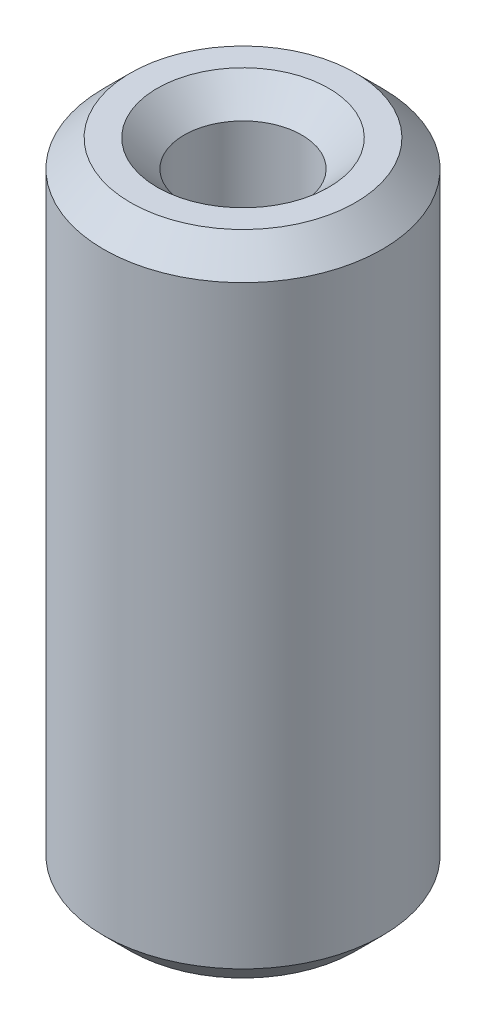
ISO-10303-21;
HEADER;
FILE_DESCRIPTION(('STEP AP214'),'2;1');
FILE_NAME('part.step','',(''),(''),'','','');
FILE_SCHEMA(('AUTOMOTIVE_DESIGN { 1 0 10303 214 1 1 1 1 }'));
ENDSEC;
DATA;
#1=APPLICATION_CONTEXT('core data for automotive mechanical design processes');
#2=APPLICATION_PROTOCOL_DEFINITION('international standard','automotive_design',2000,#1);
#3=PRODUCT_CONTEXT('',#1,'mechanical');
#4=PRODUCT('Part','Part','',(#3));
#5=PRODUCT_RELATED_PRODUCT_CATEGORY('part','',(#4));
#6=PRODUCT_DEFINITION_FORMATION('','',#4);
#7=PRODUCT_DEFINITION_CONTEXT('part definition',#1,'design');
#8=PRODUCT_DEFINITION('design','',#6,#7);
#9=PRODUCT_DEFINITION_SHAPE('','',#8);
#10=(LENGTH_UNIT() NAMED_UNIT(*) SI_UNIT(.MILLI.,.METRE.));
#11=(NAMED_UNIT(*) PLANE_ANGLE_UNIT() SI_UNIT($,.RADIAN.));
#12=(NAMED_UNIT(*) SI_UNIT($,.STERADIAN.) SOLID_ANGLE_UNIT());
#13=UNCERTAINTY_MEASURE_WITH_UNIT(LENGTH_MEASURE(1.E-05),#10,'distance_accuracy_value','');
#14=(GEOMETRIC_REPRESENTATION_CONTEXT(3) GLOBAL_UNCERTAINTY_ASSIGNED_CONTEXT((#13)) GLOBAL_UNIT_ASSIGNED_CONTEXT((#10,
#11,#12)) REPRESENTATION_CONTEXT('',''));
#15=CARTESIAN_POINT('',(0.,0.,0.));
#16=DIRECTION('',(0.,0.,1.));
#17=DIRECTION('',(1.,0.,0.));
#18=AXIS2_PLACEMENT_3D('',#15,#16,#17);
#19=CARTESIAN_POINT('',(0.,34.8866646161189,0.));
#20=DIRECTION('',(0.,-1.,0.));
#21=DIRECTION('',(0.,0.,-1.));
#22=AXIS2_PLACEMENT_3D('',#19,#20,#21);
#23=CYLINDRICAL_SURFACE('',#22,7.5);
#24=CARTESIAN_POINT('',(0.,1.45143759762098,0.));
#25=DIRECTION('',(0.,1.,0.));
#26=DIRECTION('',(0.,0.,1.));
#27=AXIS2_PLACEMENT_3D('',#24,#25,#26);
#28=CIRCLE('',#27,7.5);
#29=CARTESIAN_POINT('',(0.,1.45143759762098,7.5));
#30=VERTEX_POINT('',#29);
#31=EDGE_CURVE('E10',#30,#30,#28,.T.);
#32=ORIENTED_EDGE('',*,*,#31,.T.);
#33=EDGE_LOOP('',(#32));
#34=FACE_BOUND('',#33,.T.);
#35=CARTESIAN_POINT('',(0.,33.4352270184979,0.));
#36=DIRECTION('',(0.,1.,0.));
#37=DIRECTION('',(0.,0.,1.));
#38=AXIS2_PLACEMENT_3D('',#35,#36,#37);
#39=CIRCLE('',#38,7.5);
#40=CARTESIAN_POINT('',(0.,33.4352270184979,7.5));
#41=VERTEX_POINT('',#40);
#42=EDGE_CURVE('E50',#41,#41,#39,.F.);
#43=ORIENTED_EDGE('',*,*,#42,.T.);
#44=EDGE_LOOP('',(#43));
#45=FACE_BOUND('',#44,.T.);
#46=ADVANCED_FACE('F39',(#34,#45),#23,.T.);
#47=CARTESIAN_POINT('',(0.,34.8866646161189,0.));
#48=DIRECTION('',(0.,1.,0.));
#49=DIRECTION('',(0.,0.,1.));
#50=AXIS2_PLACEMENT_3D('',#47,#48,#49);
#51=PLANE('',#50);
#52=CARTESIAN_POINT('',(0.,34.8866646161189,0.));
#53=DIRECTION('',(0.,1.,0.));
#54=DIRECTION('',(0.,0.,1.));
#55=AXIS2_PLACEMENT_3D('',#52,#53,#54);
#56=CIRCLE('',#55,4.61648147498148);
#57=CARTESIAN_POINT('',(0.,34.8866646161189,4.61648147498148));
#58=VERTEX_POINT('',#57);
#59=EDGE_CURVE('E58',#58,#58,#56,.F.);
#60=ORIENTED_EDGE('',*,*,#59,.T.);
#61=EDGE_LOOP('',(#60));
#62=FACE_BOUND('',#61,.T.);
#63=CARTESIAN_POINT('',(0.,34.8866646161189,0.));
#64=DIRECTION('',(0.,1.,0.));
#65=DIRECTION('',(0.,0.,1.));
#66=AXIS2_PLACEMENT_3D('',#63,#64,#65);
#67=CIRCLE('',#66,6.04856240237902);
#68=CARTESIAN_POINT('',(0.,34.8866646161189,6.04856240237902));
#69=VERTEX_POINT('',#68);
#70=EDGE_CURVE('E61',#69,#69,#67,.T.);
#71=ORIENTED_EDGE('',*,*,#70,.T.);
#72=EDGE_LOOP('',(#71));
#73=FACE_BOUND('',#72,.T.);
#74=ADVANCED_FACE('F88',(#62,#73),#51,.T.);
#75=CARTESIAN_POINT('',(0.,0.,0.));
#76=DIRECTION('',(0.,1.,0.));
#77=DIRECTION('',(0.,0.,1.));
#78=AXIS2_PLACEMENT_3D('',#75,#76,#77);
#79=PLANE('',#78);
#80=CARTESIAN_POINT('',(0.,0.,0.));
#81=DIRECTION('',(0.,1.,0.));
#82=DIRECTION('',(0.,0.,1.));
#83=AXIS2_PLACEMENT_3D('',#80,#81,#82);
#84=CIRCLE('',#83,4.61648147498147);
#85=CARTESIAN_POINT('',(0.,0.,4.61648147498147));
#86=VERTEX_POINT('',#85);
#87=EDGE_CURVE('E51',#86,#86,#84,.T.);
#88=ORIENTED_EDGE('',*,*,#87,.T.);
#89=EDGE_LOOP('',(#88));
#90=FACE_BOUND('',#89,.T.);
#91=CARTESIAN_POINT('',(0.,0.,0.));
#92=DIRECTION('',(0.,1.,0.));
#93=DIRECTION('',(0.,0.,1.));
#94=AXIS2_PLACEMENT_3D('',#91,#92,#93);
#95=CIRCLE('',#94,6.04856240237901);
#96=CARTESIAN_POINT('',(0.,0.,6.04856240237901));
#97=VERTEX_POINT('',#96);
#98=EDGE_CURVE('E54',#97,#97,#95,.F.);
#99=ORIENTED_EDGE('',*,*,#98,.T.);
#100=EDGE_LOOP('',(#99));
#101=FACE_BOUND('',#100,.T.);
#102=ADVANCED_FACE('F83',(#90,#101),#79,.F.);
#103=CARTESIAN_POINT('',(0.,34.8866646161189,0.));
#104=DIRECTION('',(0.,-1.,0.));
#105=DIRECTION('',(0.,0.,-1.));
#106=AXIS2_PLACEMENT_3D('',#103,#104,#105);
#107=CYLINDRICAL_SURFACE('',#106,3.16504387736049);
#108=CARTESIAN_POINT('',(0.,33.4352270184979,0.));
#109=DIRECTION('',(0.,1.,0.));
#110=DIRECTION('',(0.,0.,1.));
#111=AXIS2_PLACEMENT_3D('',#108,#109,#110);
#112=CIRCLE('',#111,3.16504387736049);
#113=CARTESIAN_POINT('',(0.,33.4352270184979,3.16504387736049));
#114=VERTEX_POINT('',#113);
#115=EDGE_CURVE('E67',#114,#114,#112,.T.);
#116=ORIENTED_EDGE('',*,*,#115,.T.);
#117=EDGE_LOOP('',(#116));
#118=FACE_BOUND('',#117,.T.);
#119=CARTESIAN_POINT('',(0.,1.45143759762099,0.));
#120=DIRECTION('',(0.,1.,0.));
#121=DIRECTION('',(0.,0.,1.));
#122=AXIS2_PLACEMENT_3D('',#119,#120,#121);
#123=CIRCLE('',#122,3.16504387736049);
#124=CARTESIAN_POINT('',(0.,1.45143759762099,3.16504387736049));
#125=VERTEX_POINT('',#124);
#126=EDGE_CURVE('E69',#125,#125,#123,.F.);
#127=ORIENTED_EDGE('',*,*,#126,.T.);
#128=EDGE_LOOP('',(#127));
#129=FACE_BOUND('',#128,.T.);
#130=ADVANCED_FACE('F71',(#118,#129),#107,.F.);
#131=CARTESIAN_POINT('',(0.,33.4352270184979,0.));
#132=DIRECTION('',(0.,1.,0.));
#133=DIRECTION('',(0.,0.,1.));
#134=AXIS2_PLACEMENT_3D('',#131,#132,#133);
#135=CONICAL_SURFACE('',#134,3.16504387736049,0.785398163397452);
#136=ORIENTED_EDGE('',*,*,#59,.F.);
#137=EDGE_LOOP('',(#136));
#138=FACE_BOUND('',#137,.T.);
#139=ORIENTED_EDGE('',*,*,#115,.F.);
#140=EDGE_LOOP('',(#139));
#141=FACE_BOUND('',#140,.T.);
#142=ADVANCED_FACE('F77',(#138,#141),#135,.F.);
#143=CARTESIAN_POINT('',(0.,0.,0.));
#144=DIRECTION('',(0.,-1.,0.));
#145=DIRECTION('',(0.,0.,-1.));
#146=AXIS2_PLACEMENT_3D('',#143,#144,#145);
#147=CONICAL_SURFACE('',#146,4.61648147498147,0.785398163397444);
#148=ORIENTED_EDGE('',*,*,#126,.F.);
#149=EDGE_LOOP('',(#148));
#150=FACE_BOUND('',#149,.T.);
#151=ORIENTED_EDGE('',*,*,#87,.F.);
#152=EDGE_LOOP('',(#151));
#153=FACE_BOUND('',#152,.T.);
#154=ADVANCED_FACE('F73',(#150,#153),#147,.F.);
#155=CARTESIAN_POINT('',(0.,1.45143759762098,0.));
#156=DIRECTION('',(0.,1.,0.));
#157=DIRECTION('',(0.,0.,1.));
#158=AXIS2_PLACEMENT_3D('',#155,#156,#157);
#159=CONICAL_SURFACE('',#158,7.5,0.785398163397452);
#160=ORIENTED_EDGE('',*,*,#98,.F.);
#161=EDGE_LOOP('',(#160));
#162=FACE_BOUND('',#161,.T.);
#163=ORIENTED_EDGE('',*,*,#31,.F.);
#164=EDGE_LOOP('',(#163));
#165=FACE_BOUND('',#164,.T.);
#166=ADVANCED_FACE('F76',(#162,#165),#159,.T.);
#167=CARTESIAN_POINT('',(0.,34.8866646161189,0.));
#168=DIRECTION('',(0.,-1.,0.));
#169=DIRECTION('',(0.,0.,-1.));
#170=AXIS2_PLACEMENT_3D('',#167,#168,#169);
#171=CONICAL_SURFACE('',#170,6.04856240237902,0.785398163397445);
#172=ORIENTED_EDGE('',*,*,#42,.F.);
#173=EDGE_LOOP('',(#172));
#174=FACE_BOUND('',#173,.T.);
#175=ORIENTED_EDGE('',*,*,#70,.F.);
#176=EDGE_LOOP('',(#175));
#177=FACE_BOUND('',#176,.T.);
#178=ADVANCED_FACE('F45',(#174,#177),#171,.T.);
#179=CLOSED_SHELL('',(#46,#74,#102,#130,#142,#154,#166,#178));
#180=MANIFOLD_SOLID_BREP('B2',#179);
#181=ADVANCED_BREP_SHAPE_REPRESENTATION('',(#18,#180),#14);
#182=SHAPE_DEFINITION_REPRESENTATION(#9,#181);
ENDSEC;
END-ISO-10303-21;
